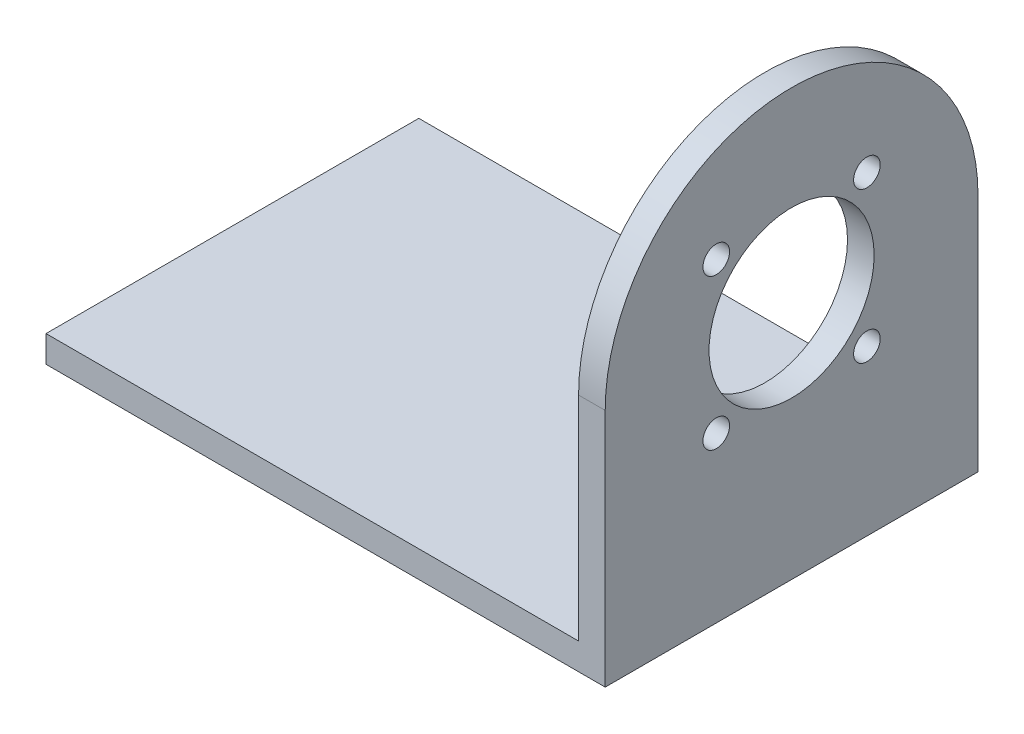
ISO-10303-21;
HEADER;
FILE_DESCRIPTION(('STEP AP214'),'2;1');
FILE_NAME('part.step','',(''),(''),'','','');
FILE_SCHEMA(('AUTOMOTIVE_DESIGN { 1 0 10303 214 1 1 1 1 }'));
ENDSEC;
DATA;
#1=APPLICATION_CONTEXT('core data for automotive mechanical design processes');
#2=APPLICATION_PROTOCOL_DEFINITION('international standard','automotive_design',2000,#1);
#3=PRODUCT_CONTEXT('',#1,'mechanical');
#4=PRODUCT('Part','Part','',(#3));
#5=PRODUCT_RELATED_PRODUCT_CATEGORY('part','',(#4));
#6=PRODUCT_DEFINITION_FORMATION('','',#4);
#7=PRODUCT_DEFINITION_CONTEXT('part definition',#1,'design');
#8=PRODUCT_DEFINITION('design','',#6,#7);
#9=PRODUCT_DEFINITION_SHAPE('','',#8);
#10=(LENGTH_UNIT() NAMED_UNIT(*) SI_UNIT(.MILLI.,.METRE.));
#11=(NAMED_UNIT(*) PLANE_ANGLE_UNIT() SI_UNIT($,.RADIAN.));
#12=(NAMED_UNIT(*) SI_UNIT($,.STERADIAN.) SOLID_ANGLE_UNIT());
#13=UNCERTAINTY_MEASURE_WITH_UNIT(LENGTH_MEASURE(1.E-05),#10,'distance_accuracy_value','');
#14=(GEOMETRIC_REPRESENTATION_CONTEXT(3) GLOBAL_UNCERTAINTY_ASSIGNED_CONTEXT((#13)) GLOBAL_UNIT_ASSIGNED_CONTEXT((#10,
#11,#12)) REPRESENTATION_CONTEXT('',''));
#15=CARTESIAN_POINT('',(0.,0.,0.));
#16=DIRECTION('',(0.,0.,1.));
#17=DIRECTION('',(1.,0.,0.));
#18=AXIS2_PLACEMENT_3D('',#15,#16,#17);
#19=CARTESIAN_POINT('',(52.5,5.,35.));
#20=DIRECTION('',(-1.,0.,0.));
#21=DIRECTION('',(0.,0.,1.));
#22=AXIS2_PLACEMENT_3D('',#19,#20,#21);
#23=PLANE('',#22);
#24=CARTESIAN_POINT('',(52.5,59.1421356237307,14.1421356237308));
#25=DIRECTION('',(1.,0.,0.));
#26=DIRECTION('',(0.,0.,-1.));
#27=AXIS2_PLACEMENT_3D('',#24,#25,#26);
#28=CIRCLE('',#27,2.5);
#29=CARTESIAN_POINT('',(52.5,59.1421356237307,11.6421356237308));
#30=VERTEX_POINT('',#29);
#31=EDGE_CURVE('E164',#30,#30,#28,.T.);
#32=ORIENTED_EDGE('',*,*,#31,.F.);
#33=EDGE_LOOP('',(#32));
#34=FACE_BOUND('',#33,.T.);
#35=CARTESIAN_POINT('',(52.5,30.8578643762688,14.1421356237307));
#36=DIRECTION('',(1.,0.,0.));
#37=DIRECTION('',(0.,0.,-1.));
#38=AXIS2_PLACEMENT_3D('',#35,#36,#37);
#39=CIRCLE('',#38,2.5);
#40=CARTESIAN_POINT('',(52.5,30.8578643762688,11.6421356237307));
#41=VERTEX_POINT('',#40);
#42=EDGE_CURVE('E163',#41,#41,#39,.T.);
#43=ORIENTED_EDGE('',*,*,#42,.F.);
#44=EDGE_LOOP('',(#43));
#45=FACE_BOUND('',#44,.T.);
#46=CARTESIAN_POINT('',(52.5,30.857864376269,-14.1421356237313));
#47=DIRECTION('',(1.,0.,0.));
#48=DIRECTION('',(0.,0.,-1.));
#49=AXIS2_PLACEMENT_3D('',#46,#47,#48);
#50=CIRCLE('',#49,2.5);
#51=CARTESIAN_POINT('',(52.5,30.857864376269,-16.6421356237313));
#52=VERTEX_POINT('',#51);
#53=EDGE_CURVE('E170',#52,#52,#50,.T.);
#54=ORIENTED_EDGE('',*,*,#53,.F.);
#55=EDGE_LOOP('',(#54));
#56=FACE_BOUND('',#55,.T.);
#57=CARTESIAN_POINT('',(52.5,59.1421356237309,-14.142135623731));
#58=DIRECTION('',(1.,0.,0.));
#59=DIRECTION('',(0.,0.,-1.));
#60=AXIS2_PLACEMENT_3D('',#57,#58,#59);
#61=CIRCLE('',#60,2.5);
#62=CARTESIAN_POINT('',(52.5,59.1421356237309,-16.642135623731));
#63=VERTEX_POINT('',#62);
#64=EDGE_CURVE('E156',#63,#63,#61,.T.);
#65=ORIENTED_EDGE('',*,*,#64,.F.);
#66=EDGE_LOOP('',(#65));
#67=FACE_BOUND('',#66,.T.);
#68=CARTESIAN_POINT('',(52.5,45.,0.));
#69=DIRECTION('',(-1.,0.,0.));
#70=DIRECTION('',(0.,0.,1.));
#71=AXIS2_PLACEMENT_3D('',#68,#69,#70);
#72=CIRCLE('',#71,35.);
#73=CARTESIAN_POINT('',(52.5,45.,35.));
#74=VERTEX_POINT('',#73);
#75=CARTESIAN_POINT('',(52.5,45.,-35.));
#76=VERTEX_POINT('',#75);
#77=EDGE_CURVE('E91',#74,#76,#72,.T.);
#78=ORIENTED_EDGE('',*,*,#77,.F.);
#79=DIRECTION('',(0.,-1.,0.));
#80=VECTOR('',#79,1.);
#81=CARTESIAN_POINT('',(52.5,5.,35.));
#82=LINE('',#81,#80);
#83=CARTESIAN_POINT('',(52.5,0.,35.));
#84=VERTEX_POINT('',#83);
#85=EDGE_CURVE('E95',#74,#84,#82,.T.);
#86=ORIENTED_EDGE('',*,*,#85,.T.);
#87=DIRECTION('',(0.,0.,-1.));
#88=VECTOR('',#87,1.);
#89=CARTESIAN_POINT('',(52.5,0.,35.));
#90=LINE('',#89,#88);
#91=CARTESIAN_POINT('',(52.5,0.,-35.));
#92=VERTEX_POINT('',#91);
#93=EDGE_CURVE('E129',#84,#92,#90,.T.);
#94=ORIENTED_EDGE('',*,*,#93,.T.);
#95=DIRECTION('',(0.,-1.,0.));
#96=VECTOR('',#95,1.);
#97=CARTESIAN_POINT('',(52.5,5.,-35.));
#98=LINE('',#97,#96);
#99=EDGE_CURVE('E46',#76,#92,#98,.T.);
#100=ORIENTED_EDGE('',*,*,#99,.F.);
#101=EDGE_LOOP('',(#78,#86,#94,#100));
#102=FACE_BOUND('',#101,.T.);
#103=CARTESIAN_POINT('',(52.5,45.,0.));
#104=DIRECTION('',(1.,0.,0.));
#105=DIRECTION('',(0.,0.,-1.));
#106=AXIS2_PLACEMENT_3D('',#103,#104,#105);
#107=CIRCLE('',#106,15.5);
#108=CARTESIAN_POINT('',(52.5,45.,-15.5));
#109=VERTEX_POINT('',#108);
#110=EDGE_CURVE('E150',#109,#109,#107,.T.);
#111=ORIENTED_EDGE('',*,*,#110,.F.);
#112=EDGE_LOOP('',(#111));
#113=FACE_BOUND('',#112,.T.);
#114=ADVANCED_FACE('F39',(#34,#45,#56,#67,#102,#113),#23,.F.);
#115=CARTESIAN_POINT('',(47.5,75.,-35.));
#116=DIRECTION('',(1.,0.,0.));
#117=DIRECTION('',(0.,0.,-1.));
#118=AXIS2_PLACEMENT_3D('',#115,#116,#117);
#119=PLANE('',#118);
#120=CARTESIAN_POINT('',(47.5,59.1421356237307,14.1421356237308));
#121=DIRECTION('',(1.,0.,0.));
#122=DIRECTION('',(0.,0.,-1.));
#123=AXIS2_PLACEMENT_3D('',#120,#121,#122);
#124=CIRCLE('',#123,2.5);
#125=CARTESIAN_POINT('',(47.5,59.1421356237307,11.6421356237308));
#126=VERTEX_POINT('',#125);
#127=EDGE_CURVE('E160',#126,#126,#124,.F.);
#128=ORIENTED_EDGE('',*,*,#127,.F.);
#129=EDGE_LOOP('',(#128));
#130=FACE_BOUND('',#129,.T.);
#131=CARTESIAN_POINT('',(47.5,30.8578643762688,14.1421356237307));
#132=DIRECTION('',(1.,0.,0.));
#133=DIRECTION('',(0.,0.,-1.));
#134=AXIS2_PLACEMENT_3D('',#131,#132,#133);
#135=CIRCLE('',#134,2.5);
#136=CARTESIAN_POINT('',(47.5,30.8578643762688,11.6421356237307));
#137=VERTEX_POINT('',#136);
#138=EDGE_CURVE('E167',#137,#137,#135,.F.);
#139=ORIENTED_EDGE('',*,*,#138,.F.);
#140=EDGE_LOOP('',(#139));
#141=FACE_BOUND('',#140,.T.);
#142=CARTESIAN_POINT('',(47.5,30.857864376269,-14.1421356237313));
#143=DIRECTION('',(1.,0.,0.));
#144=DIRECTION('',(0.,0.,-1.));
#145=AXIS2_PLACEMENT_3D('',#142,#143,#144);
#146=CIRCLE('',#145,2.5);
#147=CARTESIAN_POINT('',(47.5,30.857864376269,-16.6421356237313));
#148=VERTEX_POINT('',#147);
#149=EDGE_CURVE('E159',#148,#148,#146,.F.);
#150=ORIENTED_EDGE('',*,*,#149,.F.);
#151=EDGE_LOOP('',(#150));
#152=FACE_BOUND('',#151,.T.);
#153=CARTESIAN_POINT('',(47.5,59.1421356237309,-14.142135623731));
#154=DIRECTION('',(1.,0.,0.));
#155=DIRECTION('',(0.,0.,-1.));
#156=AXIS2_PLACEMENT_3D('',#153,#154,#155);
#157=CIRCLE('',#156,2.5);
#158=CARTESIAN_POINT('',(47.5,59.1421356237309,-16.642135623731));
#159=VERTEX_POINT('',#158);
#160=EDGE_CURVE('E153',#159,#159,#157,.F.);
#161=ORIENTED_EDGE('',*,*,#160,.F.);
#162=EDGE_LOOP('',(#161));
#163=FACE_BOUND('',#162,.T.);
#164=DIRECTION('',(0.,-1.,0.));
#165=VECTOR('',#164,1.);
#166=CARTESIAN_POINT('',(47.5,75.,35.));
#167=LINE('',#166,#165);
#168=CARTESIAN_POINT('',(47.5,45.,35.));
#169=VERTEX_POINT('',#168);
#170=CARTESIAN_POINT('',(47.5,5.,35.));
#171=VERTEX_POINT('',#170);
#172=EDGE_CURVE('E133',#169,#171,#167,.T.);
#173=ORIENTED_EDGE('',*,*,#172,.F.);
#174=CARTESIAN_POINT('',(47.5,45.,0.));
#175=DIRECTION('',(-1.,0.,0.));
#176=DIRECTION('',(0.,0.,1.));
#177=AXIS2_PLACEMENT_3D('',#174,#175,#176);
#178=CIRCLE('',#177,35.);
#179=CARTESIAN_POINT('',(47.5,45.,-35.));
#180=VERTEX_POINT('',#179);
#181=EDGE_CURVE('E53',#169,#180,#178,.T.);
#182=ORIENTED_EDGE('',*,*,#181,.T.);
#183=DIRECTION('',(0.,-1.,0.));
#184=VECTOR('',#183,1.);
#185=CARTESIAN_POINT('',(47.5,75.,-35.));
#186=LINE('',#185,#184);
#187=CARTESIAN_POINT('',(47.5,5.,-35.));
#188=VERTEX_POINT('',#187);
#189=EDGE_CURVE('E59',#180,#188,#186,.T.);
#190=ORIENTED_EDGE('',*,*,#189,.T.);
#191=DIRECTION('',(0.,0.,1.));
#192=VECTOR('',#191,1.);
#193=CARTESIAN_POINT('',(47.5,5.,-35.));
#194=LINE('',#193,#192);
#195=EDGE_CURVE('E98',#188,#171,#194,.T.);
#196=ORIENTED_EDGE('',*,*,#195,.T.);
#197=EDGE_LOOP('',(#173,#182,#190,#196));
#198=FACE_BOUND('',#197,.T.);
#199=CARTESIAN_POINT('',(47.5,45.,0.));
#200=DIRECTION('',(1.,0.,0.));
#201=DIRECTION('',(0.,0.,-1.));
#202=AXIS2_PLACEMENT_3D('',#199,#200,#201);
#203=CIRCLE('',#202,15.5);
#204=CARTESIAN_POINT('',(47.5,45.,-15.5));
#205=VERTEX_POINT('',#204);
#206=EDGE_CURVE('E147',#205,#205,#203,.F.);
#207=ORIENTED_EDGE('',*,*,#206,.F.);
#208=EDGE_LOOP('',(#207));
#209=FACE_BOUND('',#208,.T.);
#210=ADVANCED_FACE('F182',(#130,#141,#152,#163,#198,#209),#119,.F.);
#211=CARTESIAN_POINT('',(-52.5,5.,-35.));
#212=DIRECTION('',(0.,0.,1.));
#213=DIRECTION('',(1.,0.,0.));
#214=AXIS2_PLACEMENT_3D('',#211,#212,#213);
#215=PLANE('',#214);
#216=DIRECTION('',(-1.,0.,0.));
#217=VECTOR('',#216,1.);
#218=CARTESIAN_POINT('',(67.5,45.,-35.));
#219=LINE('',#218,#217);
#220=EDGE_CURVE('E99',#76,#180,#219,.T.);
#221=ORIENTED_EDGE('',*,*,#220,.F.);
#222=ORIENTED_EDGE('',*,*,#99,.T.);
#223=DIRECTION('',(-1.,0.,0.));
#224=VECTOR('',#223,1.);
#225=CARTESIAN_POINT('',(-52.5,0.,-35.));
#226=LINE('',#225,#224);
#227=CARTESIAN_POINT('',(-52.5,0.,-35.));
#228=VERTEX_POINT('',#227);
#229=EDGE_CURVE('E125',#92,#228,#226,.T.);
#230=ORIENTED_EDGE('',*,*,#229,.T.);
#231=DIRECTION('',(0.,-1.,0.));
#232=VECTOR('',#231,1.);
#233=CARTESIAN_POINT('',(-52.5,5.,-35.));
#234=LINE('',#233,#232);
#235=CARTESIAN_POINT('',(-52.5,5.,-35.));
#236=VERTEX_POINT('',#235);
#237=EDGE_CURVE('E112',#236,#228,#234,.T.);
#238=ORIENTED_EDGE('',*,*,#237,.F.);
#239=DIRECTION('',(-1.,0.,0.));
#240=VECTOR('',#239,1.);
#241=CARTESIAN_POINT('',(-52.5,5.,-35.));
#242=LINE('',#241,#240);
#243=EDGE_CURVE('E138',#188,#236,#242,.T.);
#244=ORIENTED_EDGE('',*,*,#243,.F.);
#245=ORIENTED_EDGE('',*,*,#189,.F.);
#246=EDGE_LOOP('',(#221,#222,#230,#238,#244,#245));
#247=FACE_BOUND('',#246,.T.);
#248=ADVANCED_FACE('F123',(#247),#215,.F.);
#249=CARTESIAN_POINT('',(0.,5.,0.));
#250=DIRECTION('',(0.,-1.,0.));
#251=DIRECTION('',(0.,0.,-1.));
#252=AXIS2_PLACEMENT_3D('',#249,#250,#251);
#253=PLANE('',#252);
#254=ORIENTED_EDGE('',*,*,#195,.F.);
#255=ORIENTED_EDGE('',*,*,#243,.T.);
#256=DIRECTION('',(0.,0.,1.));
#257=VECTOR('',#256,1.);
#258=CARTESIAN_POINT('',(-52.5,5.,35.));
#259=LINE('',#258,#257);
#260=CARTESIAN_POINT('',(-52.5,5.,35.));
#261=VERTEX_POINT('',#260);
#262=EDGE_CURVE('E115',#236,#261,#259,.T.);
#263=ORIENTED_EDGE('',*,*,#262,.T.);
#264=DIRECTION('',(1.,0.,0.));
#265=VECTOR('',#264,1.);
#266=CARTESIAN_POINT('',(-52.5,5.,35.));
#267=LINE('',#266,#265);
#268=EDGE_CURVE('E110',#261,#171,#267,.T.);
#269=ORIENTED_EDGE('',*,*,#268,.T.);
#270=EDGE_LOOP('',(#254,#255,#263,#269));
#271=FACE_BOUND('',#270,.T.);
#272=ADVANCED_FACE('F209',(#271),#253,.F.);
#273=CARTESIAN_POINT('',(-52.5,5.,35.));
#274=DIRECTION('',(1.,0.,0.));
#275=DIRECTION('',(0.,0.,-1.));
#276=AXIS2_PLACEMENT_3D('',#273,#274,#275);
#277=PLANE('',#276);
#278=DIRECTION('',(0.,0.,1.));
#279=VECTOR('',#278,1.);
#280=CARTESIAN_POINT('',(-52.5,0.,35.));
#281=LINE('',#280,#279);
#282=CARTESIAN_POINT('',(-52.5,0.,35.));
#283=VERTEX_POINT('',#282);
#284=EDGE_CURVE('E130',#228,#283,#281,.T.);
#285=ORIENTED_EDGE('',*,*,#284,.T.);
#286=DIRECTION('',(0.,-1.,0.));
#287=VECTOR('',#286,1.);
#288=CARTESIAN_POINT('',(-52.5,5.,35.));
#289=LINE('',#288,#287);
#290=EDGE_CURVE('E109',#261,#283,#289,.T.);
#291=ORIENTED_EDGE('',*,*,#290,.F.);
#292=ORIENTED_EDGE('',*,*,#262,.F.);
#293=ORIENTED_EDGE('',*,*,#237,.T.);
#294=EDGE_LOOP('',(#285,#291,#292,#293));
#295=FACE_BOUND('',#294,.T.);
#296=ADVANCED_FACE('F212',(#295),#277,.F.);
#297=CARTESIAN_POINT('',(-52.5,5.,35.));
#298=DIRECTION('',(0.,0.,-1.));
#299=DIRECTION('',(-1.,0.,0.));
#300=AXIS2_PLACEMENT_3D('',#297,#298,#299);
#301=PLANE('',#300);
#302=ORIENTED_EDGE('',*,*,#85,.F.);
#303=DIRECTION('',(-1.,0.,0.));
#304=VECTOR('',#303,1.);
#305=CARTESIAN_POINT('',(67.5,45.,35.));
#306=LINE('',#305,#304);
#307=EDGE_CURVE('E11',#74,#169,#306,.T.);
#308=ORIENTED_EDGE('',*,*,#307,.T.);
#309=ORIENTED_EDGE('',*,*,#172,.T.);
#310=ORIENTED_EDGE('',*,*,#268,.F.);
#311=ORIENTED_EDGE('',*,*,#290,.T.);
#312=DIRECTION('',(1.,0.,0.));
#313=VECTOR('',#312,1.);
#314=CARTESIAN_POINT('',(-52.5,0.,35.));
#315=LINE('',#314,#313);
#316=EDGE_CURVE('E107',#283,#84,#315,.T.);
#317=ORIENTED_EDGE('',*,*,#316,.T.);
#318=EDGE_LOOP('',(#302,#308,#309,#310,#311,#317));
#319=FACE_BOUND('',#318,.T.);
#320=ADVANCED_FACE('F104',(#319),#301,.F.);
#321=CARTESIAN_POINT('',(0.,0.,0.));
#322=DIRECTION('',(0.,-1.,0.));
#323=DIRECTION('',(0.,0.,-1.));
#324=AXIS2_PLACEMENT_3D('',#321,#322,#323);
#325=PLANE('',#324);
#326=ORIENTED_EDGE('',*,*,#93,.F.);
#327=ORIENTED_EDGE('',*,*,#316,.F.);
#328=ORIENTED_EDGE('',*,*,#284,.F.);
#329=ORIENTED_EDGE('',*,*,#229,.F.);
#330=EDGE_LOOP('',(#326,#327,#328,#329));
#331=FACE_BOUND('',#330,.T.);
#332=ADVANCED_FACE('F128',(#331),#325,.T.);
#333=CARTESIAN_POINT('',(67.5,45.,0.));
#334=DIRECTION('',(-1.,0.,0.));
#335=DIRECTION('',(0.,0.,1.));
#336=AXIS2_PLACEMENT_3D('',#333,#334,#335);
#337=CYLINDRICAL_SURFACE('',#336,35.);
#338=ORIENTED_EDGE('',*,*,#77,.T.);
#339=ORIENTED_EDGE('',*,*,#220,.T.);
#340=ORIENTED_EDGE('',*,*,#181,.F.);
#341=ORIENTED_EDGE('',*,*,#307,.F.);
#342=EDGE_LOOP('',(#338,#339,#340,#341));
#343=FACE_BOUND('',#342,.T.);
#344=ADVANCED_FACE('F101',(#343),#337,.T.);
#345=CARTESIAN_POINT('',(-24.6248916810278,45.,0.));
#346=DIRECTION('',(1.,0.,0.));
#347=DIRECTION('',(0.,0.,-1.));
#348=AXIS2_PLACEMENT_3D('',#345,#346,#347);
#349=CYLINDRICAL_SURFACE('',#348,15.5);
#350=ORIENTED_EDGE('',*,*,#206,.T.);
#351=EDGE_LOOP('',(#350));
#352=FACE_BOUND('',#351,.T.);
#353=ORIENTED_EDGE('',*,*,#110,.T.);
#354=EDGE_LOOP('',(#353));
#355=FACE_BOUND('',#354,.T.);
#356=ADVANCED_FACE('F188',(#352,#355),#349,.F.);
#357=CARTESIAN_POINT('',(40.4289321881345,59.1421356237309,-14.142135623731));
#358=DIRECTION('',(1.,0.,0.));
#359=DIRECTION('',(0.,0.,-1.));
#360=AXIS2_PLACEMENT_3D('',#357,#358,#359);
#361=CYLINDRICAL_SURFACE('',#360,2.5);
#362=ORIENTED_EDGE('',*,*,#160,.T.);
#363=EDGE_LOOP('',(#362));
#364=FACE_BOUND('',#363,.T.);
#365=ORIENTED_EDGE('',*,*,#64,.T.);
#366=EDGE_LOOP('',(#365));
#367=FACE_BOUND('',#366,.T.);
#368=ADVANCED_FACE('F186',(#364,#367),#361,.F.);
#369=CARTESIAN_POINT('',(40.4289321881345,30.857864376269,-14.1421356237313));
#370=DIRECTION('',(1.,0.,0.));
#371=DIRECTION('',(0.,0.,-1.));
#372=AXIS2_PLACEMENT_3D('',#369,#370,#371);
#373=CYLINDRICAL_SURFACE('',#372,2.5);
#374=ORIENTED_EDGE('',*,*,#149,.T.);
#375=EDGE_LOOP('',(#374));
#376=FACE_BOUND('',#375,.T.);
#377=ORIENTED_EDGE('',*,*,#53,.T.);
#378=EDGE_LOOP('',(#377));
#379=FACE_BOUND('',#378,.T.);
#380=ADVANCED_FACE('F178',(#376,#379),#373,.F.);
#381=CARTESIAN_POINT('',(40.4289321881345,30.8578643762688,14.1421356237307));
#382=DIRECTION('',(1.,0.,0.));
#383=DIRECTION('',(0.,0.,-1.));
#384=AXIS2_PLACEMENT_3D('',#381,#382,#383);
#385=CYLINDRICAL_SURFACE('',#384,2.5);
#386=ORIENTED_EDGE('',*,*,#138,.T.);
#387=EDGE_LOOP('',(#386));
#388=FACE_BOUND('',#387,.T.);
#389=ORIENTED_EDGE('',*,*,#42,.T.);
#390=EDGE_LOOP('',(#389));
#391=FACE_BOUND('',#390,.T.);
#392=ADVANCED_FACE('F195',(#388,#391),#385,.F.);
#393=CARTESIAN_POINT('',(40.4289321881345,59.1421356237307,14.1421356237308));
#394=DIRECTION('',(1.,0.,0.));
#395=DIRECTION('',(0.,0.,-1.));
#396=AXIS2_PLACEMENT_3D('',#393,#394,#395);
#397=CYLINDRICAL_SURFACE('',#396,2.5);
#398=ORIENTED_EDGE('',*,*,#127,.T.);
#399=EDGE_LOOP('',(#398));
#400=FACE_BOUND('',#399,.T.);
#401=ORIENTED_EDGE('',*,*,#31,.T.);
#402=EDGE_LOOP('',(#401));
#403=FACE_BOUND('',#402,.T.);
#404=ADVANCED_FACE('F201',(#400,#403),#397,.F.);
#405=CLOSED_SHELL('',(#114,#210,#248,#272,#296,#320,#332,#344,#356,#368,#380,#392,#404));
#406=MANIFOLD_SOLID_BREP('B2',#405);
#407=ADVANCED_BREP_SHAPE_REPRESENTATION('',(#18,#406),#14);
#408=SHAPE_DEFINITION_REPRESENTATION(#9,#407);
ENDSEC;
END-ISO-10303-21;
